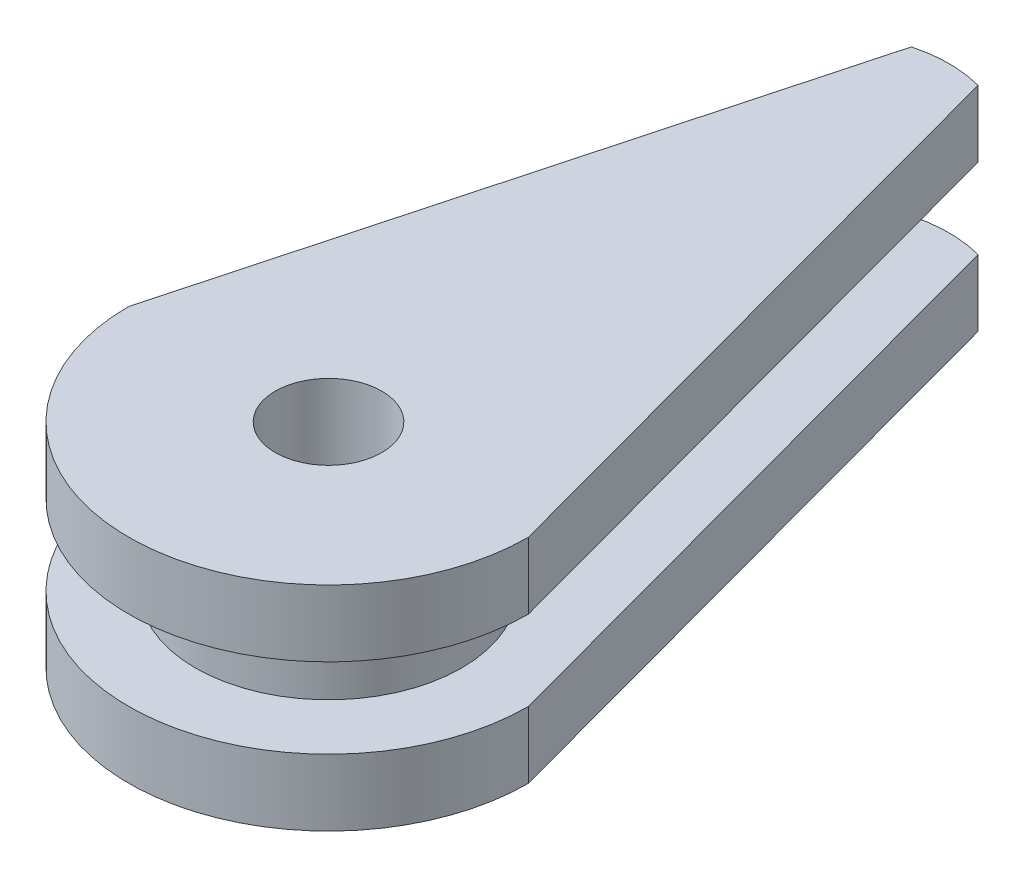
ISO-10303-21;
HEADER;
FILE_DESCRIPTION(('STEP AP214'),'2;1');
FILE_NAME('part.step','',(''),(''),'','','');
FILE_SCHEMA(('AUTOMOTIVE_DESIGN { 1 0 10303 214 1 1 1 1 }'));
ENDSEC;
DATA;
#1=APPLICATION_CONTEXT('core data for automotive mechanical design processes');
#2=APPLICATION_PROTOCOL_DEFINITION('international standard','automotive_design',2000,#1);
#3=PRODUCT_CONTEXT('',#1,'mechanical');
#4=PRODUCT('Part','Part','',(#3));
#5=PRODUCT_RELATED_PRODUCT_CATEGORY('part','',(#4));
#6=PRODUCT_DEFINITION_FORMATION('','',#4);
#7=PRODUCT_DEFINITION_CONTEXT('part definition',#1,'design');
#8=PRODUCT_DEFINITION('design','',#6,#7);
#9=PRODUCT_DEFINITION_SHAPE('','',#8);
#10=(LENGTH_UNIT() NAMED_UNIT(*) SI_UNIT(.MILLI.,.METRE.));
#11=(NAMED_UNIT(*) PLANE_ANGLE_UNIT() SI_UNIT($,.RADIAN.));
#12=(NAMED_UNIT(*) SI_UNIT($,.STERADIAN.) SOLID_ANGLE_UNIT());
#13=UNCERTAINTY_MEASURE_WITH_UNIT(LENGTH_MEASURE(1.E-05),#10,'distance_accuracy_value','');
#14=(GEOMETRIC_REPRESENTATION_CONTEXT(3) GLOBAL_UNCERTAINTY_ASSIGNED_CONTEXT((#13)) GLOBAL_UNIT_ASSIGNED_CONTEXT((#10,
#11,#12)) REPRESENTATION_CONTEXT('',''));
#15=CARTESIAN_POINT('',(0.,0.,0.));
#16=DIRECTION('',(0.,0.,1.));
#17=DIRECTION('',(1.,0.,0.));
#18=AXIS2_PLACEMENT_3D('',#15,#16,#17);
#19=CARTESIAN_POINT('',(0.,3.,0.));
#20=DIRECTION('',(0.,-1.,0.));
#21=DIRECTION('',(0.,0.,-1.));
#22=AXIS2_PLACEMENT_3D('',#19,#20,#21);
#23=CYLINDRICAL_SURFACE('',#22,5.);
#24=CARTESIAN_POINT('',(0.,3.,0.));
#25=DIRECTION('',(0.,1.,0.));
#26=DIRECTION('',(0.,0.,1.));
#27=AXIS2_PLACEMENT_3D('',#24,#25,#26);
#28=CIRCLE('',#27,5.);
#29=CARTESIAN_POINT('',(0.,3.,5.));
#30=VERTEX_POINT('',#29);
#31=EDGE_CURVE('E11',#30,#30,#28,.T.);
#32=ORIENTED_EDGE('',*,*,#31,.F.);
#33=EDGE_LOOP('',(#32));
#34=FACE_BOUND('',#33,.T.);
#35=CARTESIAN_POINT('',(0.,0.,0.));
#36=DIRECTION('',(0.,1.,0.));
#37=DIRECTION('',(0.,0.,1.));
#38=AXIS2_PLACEMENT_3D('',#35,#36,#37);
#39=CIRCLE('',#38,5.);
#40=CARTESIAN_POINT('',(0.,0.,5.));
#41=VERTEX_POINT('',#40);
#42=EDGE_CURVE('E37',#41,#41,#39,.T.);
#43=ORIENTED_EDGE('',*,*,#42,.T.);
#44=EDGE_LOOP('',(#43));
#45=FACE_BOUND('',#44,.T.);
#46=ADVANCED_FACE('F34',(#34,#45),#23,.T.);
#47=CARTESIAN_POINT('',(0.,0.,0.));
#48=DIRECTION('',(0.,-1.,0.));
#49=DIRECTION('',(0.,0.,-1.));
#50=AXIS2_PLACEMENT_3D('',#47,#48,#49);
#51=PLANE('',#50);
#52=ORIENTED_EDGE('',*,*,#42,.F.);
#53=EDGE_LOOP('',(#52));
#54=FACE_BOUND('',#53,.T.);
#55=CARTESIAN_POINT('',(0.,0.,-18.5));
#56=DIRECTION('',(0.,-1.,0.));
#57=DIRECTION('',(0.,0.,-1.));
#58=AXIS2_PLACEMENT_3D('',#55,#56,#57);
#59=CIRCLE('',#58,4.7909419741842);
#60=CARTESIAN_POINT('',(1.25,0.,-23.125));
#61=VERTEX_POINT('',#60);
#62=CARTESIAN_POINT('',(-1.25,0.,-23.125));
#63=VERTEX_POINT('',#62);
#64=EDGE_CURVE('E104',#61,#63,#59,.F.);
#65=ORIENTED_EDGE('',*,*,#64,.T.);
#66=DIRECTION('',(0.260909025142775,0.,-0.965363393028266));
#67=VECTOR('',#66,1.);
#68=CARTESIAN_POINT('',(-6.98944860449285,0.,-1.88904016337645));
#69=LINE('',#68,#67);
#70=CARTESIAN_POINT('',(-7.5,0.,0.));
#71=VERTEX_POINT('',#70);
#72=EDGE_CURVE('E208',#71,#63,#69,.T.);
#73=ORIENTED_EDGE('',*,*,#72,.F.);
#74=CARTESIAN_POINT('',(0.,0.,0.));
#75=DIRECTION('',(0.,-1.,0.));
#76=DIRECTION('',(0.,0.,-1.));
#77=AXIS2_PLACEMENT_3D('',#74,#75,#76);
#78=CIRCLE('',#77,7.5);
#79=CARTESIAN_POINT('',(7.5,0.,0.));
#80=VERTEX_POINT('',#79);
#81=EDGE_CURVE('E139',#71,#80,#78,.F.);
#82=ORIENTED_EDGE('',*,*,#81,.T.);
#83=DIRECTION('',(0.260909025142775,0.,0.965363393028266));
#84=VECTOR('',#83,1.);
#85=CARTESIAN_POINT('',(6.98944860449285,0.,-1.88904016337645));
#86=LINE('',#85,#84);
#87=EDGE_CURVE('E134',#61,#80,#86,.T.);
#88=ORIENTED_EDGE('',*,*,#87,.F.);
#89=EDGE_LOOP('',(#65,#73,#82,#88));
#90=FACE_BOUND('',#89,.T.);
#91=ADVANCED_FACE('F185',(#54,#90),#51,.F.);
#92=CARTESIAN_POINT('',(0.,3.,0.));
#93=DIRECTION('',(0.,1.,0.));
#94=DIRECTION('',(0.,0.,-1.));
#95=AXIS2_PLACEMENT_3D('',#92,#93,#94);
#96=PLANE('',#95);
#97=ORIENTED_EDGE('',*,*,#31,.T.);
#98=EDGE_LOOP('',(#97));
#99=FACE_BOUND('',#98,.T.);
#100=CARTESIAN_POINT('',(0.,3.,0.));
#101=DIRECTION('',(0.,1.,0.));
#102=DIRECTION('',(0.,0.,1.));
#103=AXIS2_PLACEMENT_3D('',#100,#101,#102);
#104=CIRCLE('',#103,7.5);
#105=CARTESIAN_POINT('',(7.5,3.,0.));
#106=VERTEX_POINT('',#105);
#107=CARTESIAN_POINT('',(-7.5,3.,0.));
#108=VERTEX_POINT('',#107);
#109=EDGE_CURVE('E48',#106,#108,#104,.F.);
#110=ORIENTED_EDGE('',*,*,#109,.T.);
#111=DIRECTION('',(-0.260909025142775,0.,0.965363393028266));
#112=VECTOR('',#111,1.);
#113=CARTESIAN_POINT('',(-6.98944860449285,3.,-1.88904016337645));
#114=LINE('',#113,#112);
#115=CARTESIAN_POINT('',(-1.25,3.,-23.125));
#116=VERTEX_POINT('',#115);
#117=EDGE_CURVE('E141',#116,#108,#114,.T.);
#118=ORIENTED_EDGE('',*,*,#117,.F.);
#119=CARTESIAN_POINT('',(0.,3.,-18.5));
#120=DIRECTION('',(0.,1.,0.));
#121=DIRECTION('',(0.,0.,1.));
#122=AXIS2_PLACEMENT_3D('',#119,#120,#121);
#123=CIRCLE('',#122,4.7909419741842);
#124=CARTESIAN_POINT('',(1.25,3.,-23.125));
#125=VERTEX_POINT('',#124);
#126=EDGE_CURVE('E53',#125,#116,#123,.T.);
#127=ORIENTED_EDGE('',*,*,#126,.F.);
#128=DIRECTION('',(-0.260909025142775,0.,-0.965363393028266));
#129=VECTOR('',#128,1.);
#130=CARTESIAN_POINT('',(6.98944860449285,3.,-1.88904016337645));
#131=LINE('',#130,#129);
#132=EDGE_CURVE('E146',#106,#125,#131,.T.);
#133=ORIENTED_EDGE('',*,*,#132,.F.);
#134=EDGE_LOOP('',(#110,#118,#127,#133));
#135=FACE_BOUND('',#134,.T.);
#136=ADVANCED_FACE('F183',(#99,#135),#96,.F.);
#137=CARTESIAN_POINT('',(0.,-31.2502862419802,-18.5));
#138=DIRECTION('',(0.,1.,0.));
#139=DIRECTION('',(0.,0.,1.));
#140=AXIS2_PLACEMENT_3D('',#137,#138,#139);
#141=CYLINDRICAL_SURFACE('',#140,4.7909419741842);
#142=DIRECTION('',(0.,1.,0.));
#143=VECTOR('',#142,1.);
#144=CARTESIAN_POINT('',(1.25,-31.2502862419802,-23.125));
#145=LINE('',#144,#143);
#146=CARTESIAN_POINT('',(1.25,5.5,-23.125));
#147=VERTEX_POINT('',#146);
#148=EDGE_CURVE('E160',#125,#147,#145,.T.);
#149=ORIENTED_EDGE('',*,*,#148,.F.);
#150=ORIENTED_EDGE('',*,*,#126,.T.);
#151=DIRECTION('',(0.,1.,0.));
#152=VECTOR('',#151,1.);
#153=CARTESIAN_POINT('',(-1.25,-31.2502862419802,-23.125));
#154=LINE('',#153,#152);
#155=CARTESIAN_POINT('',(-1.25,5.5,-23.125));
#156=VERTEX_POINT('',#155);
#157=EDGE_CURVE('E164',#116,#156,#154,.T.);
#158=ORIENTED_EDGE('',*,*,#157,.T.);
#159=CARTESIAN_POINT('',(0.,5.5,-18.5));
#160=DIRECTION('',(0.,1.,0.));
#161=DIRECTION('',(0.,0.,1.));
#162=AXIS2_PLACEMENT_3D('',#159,#160,#161);
#163=CIRCLE('',#162,4.7909419741842);
#164=EDGE_CURVE('E151',#156,#147,#163,.F.);
#165=ORIENTED_EDGE('',*,*,#164,.T.);
#166=EDGE_LOOP('',(#149,#150,#158,#165));
#167=FACE_BOUND('',#166,.T.);
#168=ADVANCED_FACE('F173',(#167),#141,.T.);
#169=CARTESIAN_POINT('',(-6.98944860449285,-31.2502862419802,-1.88904016337645));
#170=DIRECTION('',(0.965363393028266,0.,0.260909025142775));
#171=DIRECTION('',(0.260909025142775,0.,-0.965363393028266));
#172=AXIS2_PLACEMENT_3D('',#169,#170,#171);
#173=PLANE('',#172);
#174=ORIENTED_EDGE('',*,*,#157,.F.);
#175=ORIENTED_EDGE('',*,*,#117,.T.);
#176=DIRECTION('',(0.,1.,0.));
#177=VECTOR('',#176,1.);
#178=CARTESIAN_POINT('',(-7.5,-31.2502862419802,0.));
#179=LINE('',#178,#177);
#180=CARTESIAN_POINT('',(-7.5,5.5,0.));
#181=VERTEX_POINT('',#180);
#182=EDGE_CURVE('E162',#108,#181,#179,.T.);
#183=ORIENTED_EDGE('',*,*,#182,.T.);
#184=DIRECTION('',(0.260909025142775,0.,-0.965363393028266));
#185=VECTOR('',#184,1.);
#186=CARTESIAN_POINT('',(-6.98944860449285,5.5,-1.88904016337645));
#187=LINE('',#186,#185);
#188=EDGE_CURVE('E154',#181,#156,#187,.T.);
#189=ORIENTED_EDGE('',*,*,#188,.T.);
#190=EDGE_LOOP('',(#174,#175,#183,#189));
#191=FACE_BOUND('',#190,.T.);
#192=ADVANCED_FACE('F182',(#191),#173,.F.);
#193=CARTESIAN_POINT('',(0.,-31.2502862419802,0.));
#194=DIRECTION('',(0.,1.,0.));
#195=DIRECTION('',(0.,0.,1.));
#196=AXIS2_PLACEMENT_3D('',#193,#194,#195);
#197=CYLINDRICAL_SURFACE('',#196,7.5);
#198=ORIENTED_EDGE('',*,*,#109,.F.);
#199=DIRECTION('',(0.,1.,0.));
#200=VECTOR('',#199,1.);
#201=CARTESIAN_POINT('',(7.5,-31.2502862419802,0.));
#202=LINE('',#201,#200);
#203=CARTESIAN_POINT('',(7.5,5.5,0.));
#204=VERTEX_POINT('',#203);
#205=EDGE_CURVE('E142',#106,#204,#202,.T.);
#206=ORIENTED_EDGE('',*,*,#205,.T.);
#207=CARTESIAN_POINT('',(0.,5.5,0.));
#208=DIRECTION('',(0.,1.,0.));
#209=DIRECTION('',(0.,0.,1.));
#210=AXIS2_PLACEMENT_3D('',#207,#208,#209);
#211=CIRCLE('',#210,7.5);
#212=EDGE_CURVE('E157',#181,#204,#211,.T.);
#213=ORIENTED_EDGE('',*,*,#212,.F.);
#214=ORIENTED_EDGE('',*,*,#182,.F.);
#215=EDGE_LOOP('',(#198,#206,#213,#214));
#216=FACE_BOUND('',#215,.T.);
#217=ADVANCED_FACE('F180',(#216),#197,.T.);
#218=CARTESIAN_POINT('',(6.98944860449285,-31.2502862419802,-1.88904016337645));
#219=DIRECTION('',(-0.965363393028266,0.,0.260909025142775));
#220=DIRECTION('',(0.260909025142775,0.,0.965363393028266));
#221=AXIS2_PLACEMENT_3D('',#218,#219,#220);
#222=PLANE('',#221);
#223=ORIENTED_EDGE('',*,*,#205,.F.);
#224=ORIENTED_EDGE('',*,*,#132,.T.);
#225=ORIENTED_EDGE('',*,*,#148,.T.);
#226=DIRECTION('',(0.260909025142775,0.,0.965363393028266));
#227=VECTOR('',#226,1.);
#228=CARTESIAN_POINT('',(6.98944860449285,5.5,-1.88904016337645));
#229=LINE('',#228,#227);
#230=EDGE_CURVE('E148',#147,#204,#229,.T.);
#231=ORIENTED_EDGE('',*,*,#230,.T.);
#232=EDGE_LOOP('',(#223,#224,#225,#231));
#233=FACE_BOUND('',#232,.T.);
#234=ADVANCED_FACE('F169',(#233),#222,.F.);
#235=CARTESIAN_POINT('',(0.,5.5,0.));
#236=DIRECTION('',(0.,1.,0.));
#237=DIRECTION('',(0.,0.,-1.));
#238=AXIS2_PLACEMENT_3D('',#235,#236,#237);
#239=PLANE('',#238);
#240=CARTESIAN_POINT('',(0.,5.5,0.));
#241=DIRECTION('',(0.,-1.,0.));
#242=DIRECTION('',(0.,0.,-1.));
#243=AXIS2_PLACEMENT_3D('',#240,#241,#242);
#244=CIRCLE('',#243,2.);
#245=CARTESIAN_POINT('',(0.,5.5,-2.));
#246=VERTEX_POINT('',#245);
#247=EDGE_CURVE('E122',#246,#246,#244,.T.);
#248=ORIENTED_EDGE('',*,*,#247,.T.);
#249=EDGE_LOOP('',(#248));
#250=FACE_BOUND('',#249,.T.);
#251=ORIENTED_EDGE('',*,*,#230,.F.);
#252=ORIENTED_EDGE('',*,*,#164,.F.);
#253=ORIENTED_EDGE('',*,*,#188,.F.);
#254=ORIENTED_EDGE('',*,*,#212,.T.);
#255=EDGE_LOOP('',(#251,#252,#253,#254));
#256=FACE_BOUND('',#255,.T.);
#257=ADVANCED_FACE('F177',(#250,#256),#239,.T.);
#258=CARTESIAN_POINT('',(6.98944860449285,34.2502862419802,-1.88904016337645));
#259=DIRECTION('',(-0.965363393028266,0.,0.260909025142775));
#260=DIRECTION('',(0.260909025142775,0.,0.965363393028266));
#261=AXIS2_PLACEMENT_3D('',#258,#259,#260);
#262=PLANE('',#261);
#263=DIRECTION('',(0.,-1.,0.));
#264=VECTOR('',#263,1.);
#265=CARTESIAN_POINT('',(1.25,34.2502862419802,-23.125));
#266=LINE('',#265,#264);
#267=CARTESIAN_POINT('',(1.25,-2.5,-23.125));
#268=VERTEX_POINT('',#267);
#269=EDGE_CURVE('E98',#61,#268,#266,.T.);
#270=ORIENTED_EDGE('',*,*,#269,.F.);
#271=ORIENTED_EDGE('',*,*,#87,.T.);
#272=DIRECTION('',(0.,-1.,0.));
#273=VECTOR('',#272,1.);
#274=CARTESIAN_POINT('',(7.5,34.2502862419802,0.));
#275=LINE('',#274,#273);
#276=CARTESIAN_POINT('',(7.5,-2.5,0.));
#277=VERTEX_POINT('',#276);
#278=EDGE_CURVE('E107',#80,#277,#275,.T.);
#279=ORIENTED_EDGE('',*,*,#278,.T.);
#280=DIRECTION('',(-0.260909025142775,0.,-0.965363393028266));
#281=VECTOR('',#280,1.);
#282=CARTESIAN_POINT('',(6.98944860449285,-2.5,-1.88904016337645));
#283=LINE('',#282,#281);
#284=EDGE_CURVE('E111',#277,#268,#283,.T.);
#285=ORIENTED_EDGE('',*,*,#284,.T.);
#286=EDGE_LOOP('',(#270,#271,#279,#285));
#287=FACE_BOUND('',#286,.T.);
#288=ADVANCED_FACE('F112',(#287),#262,.F.);
#289=CARTESIAN_POINT('',(0.,34.2502862419802,0.));
#290=DIRECTION('',(0.,-1.,0.));
#291=DIRECTION('',(0.,0.,-1.));
#292=AXIS2_PLACEMENT_3D('',#289,#290,#291);
#293=CYLINDRICAL_SURFACE('',#292,7.5);
#294=ORIENTED_EDGE('',*,*,#81,.F.);
#295=DIRECTION('',(0.,-1.,0.));
#296=VECTOR('',#295,1.);
#297=CARTESIAN_POINT('',(-7.5,34.2502862419802,0.));
#298=LINE('',#297,#296);
#299=CARTESIAN_POINT('',(-7.5,-2.5,0.));
#300=VERTEX_POINT('',#299);
#301=EDGE_CURVE('E135',#71,#300,#298,.T.);
#302=ORIENTED_EDGE('',*,*,#301,.T.);
#303=CARTESIAN_POINT('',(0.,-2.5,0.));
#304=DIRECTION('',(0.,-1.,0.));
#305=DIRECTION('',(0.,0.,-1.));
#306=AXIS2_PLACEMENT_3D('',#303,#304,#305);
#307=CIRCLE('',#306,7.5);
#308=EDGE_CURVE('E117',#277,#300,#307,.T.);
#309=ORIENTED_EDGE('',*,*,#308,.F.);
#310=ORIENTED_EDGE('',*,*,#278,.F.);
#311=EDGE_LOOP('',(#294,#302,#309,#310));
#312=FACE_BOUND('',#311,.T.);
#313=ADVANCED_FACE('F233',(#312),#293,.T.);
#314=CARTESIAN_POINT('',(-6.98944860449285,34.2502862419802,-1.88904016337645));
#315=DIRECTION('',(0.965363393028266,0.,0.260909025142775));
#316=DIRECTION('',(0.260909025142775,0.,-0.965363393028266));
#317=AXIS2_PLACEMENT_3D('',#314,#315,#316);
#318=PLANE('',#317);
#319=ORIENTED_EDGE('',*,*,#301,.F.);
#320=ORIENTED_EDGE('',*,*,#72,.T.);
#321=DIRECTION('',(0.,-1.,0.));
#322=VECTOR('',#321,1.);
#323=CARTESIAN_POINT('',(-1.25,34.2502862419802,-23.125));
#324=LINE('',#323,#322);
#325=CARTESIAN_POINT('',(-1.25,-2.5,-23.125));
#326=VERTEX_POINT('',#325);
#327=EDGE_CURVE('E132',#63,#326,#324,.T.);
#328=ORIENTED_EDGE('',*,*,#327,.T.);
#329=DIRECTION('',(-0.260909025142775,0.,0.965363393028266));
#330=VECTOR('',#329,1.);
#331=CARTESIAN_POINT('',(-6.98944860449285,-2.5,-1.88904016337645));
#332=LINE('',#331,#330);
#333=EDGE_CURVE('E108',#326,#300,#332,.T.);
#334=ORIENTED_EDGE('',*,*,#333,.T.);
#335=EDGE_LOOP('',(#319,#320,#328,#334));
#336=FACE_BOUND('',#335,.T.);
#337=ADVANCED_FACE('F211',(#336),#318,.F.);
#338=CARTESIAN_POINT('',(0.,34.2502862419802,-18.5));
#339=DIRECTION('',(0.,-1.,0.));
#340=DIRECTION('',(0.,0.,-1.));
#341=AXIS2_PLACEMENT_3D('',#338,#339,#340);
#342=CYLINDRICAL_SURFACE('',#341,4.7909419741842);
#343=ORIENTED_EDGE('',*,*,#64,.F.);
#344=ORIENTED_EDGE('',*,*,#269,.T.);
#345=CARTESIAN_POINT('',(0.,-2.5,-18.5));
#346=DIRECTION('',(0.,-1.,0.));
#347=DIRECTION('',(0.,0.,-1.));
#348=AXIS2_PLACEMENT_3D('',#345,#346,#347);
#349=CIRCLE('',#348,4.7909419741842);
#350=EDGE_CURVE('E103',#326,#268,#349,.T.);
#351=ORIENTED_EDGE('',*,*,#350,.F.);
#352=ORIENTED_EDGE('',*,*,#327,.F.);
#353=EDGE_LOOP('',(#343,#344,#351,#352));
#354=FACE_BOUND('',#353,.T.);
#355=ADVANCED_FACE('F100',(#354),#342,.T.);
#356=CARTESIAN_POINT('',(0.,-2.5,0.));
#357=DIRECTION('',(0.,-1.,0.));
#358=DIRECTION('',(0.,0.,-1.));
#359=AXIS2_PLACEMENT_3D('',#356,#357,#358);
#360=PLANE('',#359);
#361=CARTESIAN_POINT('',(0.,-2.5,0.));
#362=DIRECTION('',(0.,-1.,0.));
#363=DIRECTION('',(0.,0.,-1.));
#364=AXIS2_PLACEMENT_3D('',#361,#362,#363);
#365=CIRCLE('',#364,2.);
#366=CARTESIAN_POINT('',(0.,-2.5,-2.));
#367=VERTEX_POINT('',#366);
#368=EDGE_CURVE('E125',#367,#367,#365,.T.);
#369=ORIENTED_EDGE('',*,*,#368,.F.);
#370=EDGE_LOOP('',(#369));
#371=FACE_BOUND('',#370,.T.);
#372=ORIENTED_EDGE('',*,*,#350,.T.);
#373=ORIENTED_EDGE('',*,*,#284,.F.);
#374=ORIENTED_EDGE('',*,*,#308,.T.);
#375=ORIENTED_EDGE('',*,*,#333,.F.);
#376=EDGE_LOOP('',(#372,#373,#374,#375));
#377=FACE_BOUND('',#376,.T.);
#378=ADVANCED_FACE('F120',(#371,#377),#360,.T.);
#379=CARTESIAN_POINT('',(0.,5.5,0.));
#380=DIRECTION('',(0.,-1.,0.));
#381=DIRECTION('',(0.,0.,-1.));
#382=AXIS2_PLACEMENT_3D('',#379,#380,#381);
#383=CYLINDRICAL_SURFACE('',#382,2.);
#384=ORIENTED_EDGE('',*,*,#247,.F.);
#385=EDGE_LOOP('',(#384));
#386=FACE_BOUND('',#385,.T.);
#387=ORIENTED_EDGE('',*,*,#368,.T.);
#388=EDGE_LOOP('',(#387));
#389=FACE_BOUND('',#388,.T.);
#390=ADVANCED_FACE('F218',(#386,#389),#383,.F.);
#391=CLOSED_SHELL('',(#46,#91,#136,#168,#192,#217,#234,#257,#288,#313,#337,#355,#378,#390));
#392=MANIFOLD_SOLID_BREP('B2',#391);
#393=ADVANCED_BREP_SHAPE_REPRESENTATION('',(#18,#392),#14);
#394=SHAPE_DEFINITION_REPRESENTATION(#9,#393);
ENDSEC;
END-ISO-10303-21;
